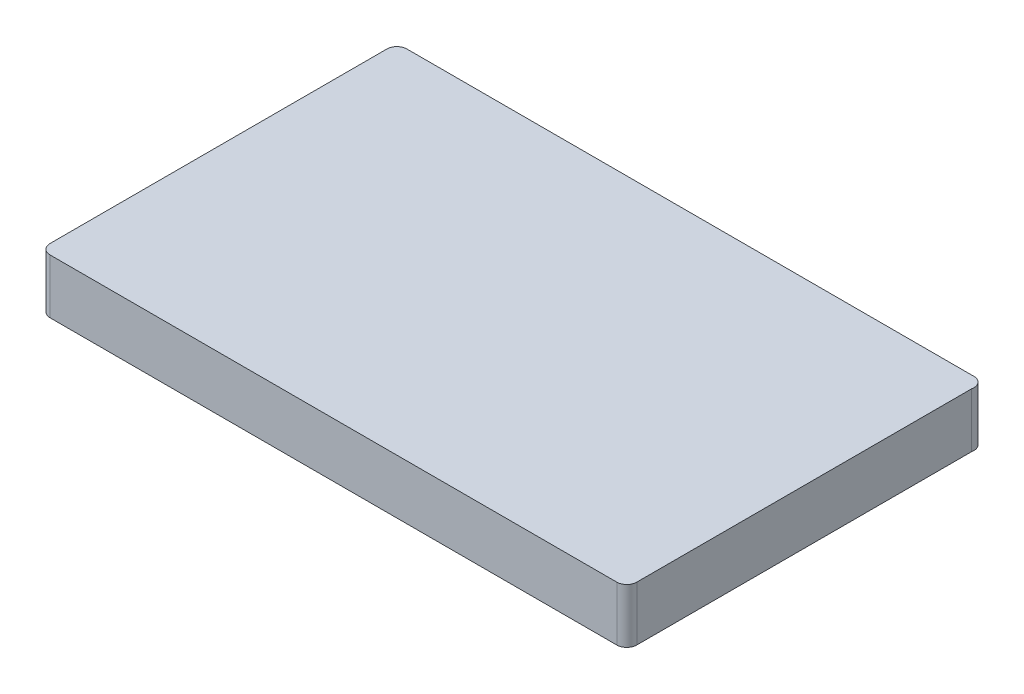
ISO-10303-21;
HEADER;
FILE_DESCRIPTION(('STEP AP214'),'2;1');
FILE_NAME('part.step','',(''),(''),'','','');
FILE_SCHEMA(('AUTOMOTIVE_DESIGN { 1 0 10303 214 1 1 1 1 }'));
ENDSEC;
DATA;
#1=APPLICATION_CONTEXT('core data for automotive mechanical design processes');
#2=APPLICATION_PROTOCOL_DEFINITION('international standard','automotive_design',2000,#1);
#3=PRODUCT_CONTEXT('',#1,'mechanical');
#4=PRODUCT('Part','Part','',(#3));
#5=PRODUCT_RELATED_PRODUCT_CATEGORY('part','',(#4));
#6=PRODUCT_DEFINITION_FORMATION('','',#4);
#7=PRODUCT_DEFINITION_CONTEXT('part definition',#1,'design');
#8=PRODUCT_DEFINITION('design','',#6,#7);
#9=PRODUCT_DEFINITION_SHAPE('','',#8);
#10=(LENGTH_UNIT() NAMED_UNIT(*) SI_UNIT(.MILLI.,.METRE.));
#11=(NAMED_UNIT(*) PLANE_ANGLE_UNIT() SI_UNIT($,.RADIAN.));
#12=(NAMED_UNIT(*) SI_UNIT($,.STERADIAN.) SOLID_ANGLE_UNIT());
#13=UNCERTAINTY_MEASURE_WITH_UNIT(LENGTH_MEASURE(1.E-05),#10,'distance_accuracy_value','');
#14=(GEOMETRIC_REPRESENTATION_CONTEXT(3) GLOBAL_UNCERTAINTY_ASSIGNED_CONTEXT((#13)) GLOBAL_UNIT_ASSIGNED_CONTEXT((#10,
#11,#12)) REPRESENTATION_CONTEXT('',''));
#15=CARTESIAN_POINT('',(0.,0.,0.));
#16=DIRECTION('',(0.,0.,1.));
#17=DIRECTION('',(1.,0.,0.));
#18=AXIS2_PLACEMENT_3D('',#15,#16,#17);
#19=CARTESIAN_POINT('',(-71.,13.65,42.2));
#20=DIRECTION('',(0.,-1.,0.));
#21=DIRECTION('',(0.,0.,-1.));
#22=AXIS2_PLACEMENT_3D('',#19,#20,#21);
#23=CYLINDRICAL_SURFACE('',#22,2.50000000000006);
#24=CARTESIAN_POINT('',(-71.,0.,42.2));
#25=DIRECTION('',(0.,1.,0.));
#26=DIRECTION('',(0.,0.,1.));
#27=AXIS2_PLACEMENT_3D('',#24,#25,#26);
#28=CIRCLE('',#27,2.50000000000006);
#29=CARTESIAN_POINT('',(-73.5000000000001,0.,42.2));
#30=VERTEX_POINT('',#29);
#31=CARTESIAN_POINT('',(-71.,0.,44.7));
#32=VERTEX_POINT('',#31);
#33=EDGE_CURVE('E129',#30,#32,#28,.T.);
#34=ORIENTED_EDGE('',*,*,#33,.T.);
#35=DIRECTION('',(0.,-1.,0.));
#36=VECTOR('',#35,1.);
#37=CARTESIAN_POINT('',(-71.,13.65,44.7));
#38=LINE('',#37,#36);
#39=CARTESIAN_POINT('',(-71.,13.65,44.7));
#40=VERTEX_POINT('',#39);
#41=EDGE_CURVE('E11',#40,#32,#38,.T.);
#42=ORIENTED_EDGE('',*,*,#41,.F.);
#43=CARTESIAN_POINT('',(-71.,13.65,42.2));
#44=DIRECTION('',(0.,1.,0.));
#45=DIRECTION('',(0.,0.,1.));
#46=AXIS2_PLACEMENT_3D('',#43,#44,#45);
#47=CIRCLE('',#46,2.50000000000006);
#48=CARTESIAN_POINT('',(-73.5000000000001,13.65,42.2));
#49=VERTEX_POINT('',#48);
#50=EDGE_CURVE('E143',#49,#40,#47,.T.);
#51=ORIENTED_EDGE('',*,*,#50,.F.);
#52=DIRECTION('',(0.,-1.,0.));
#53=VECTOR('',#52,1.);
#54=CARTESIAN_POINT('',(-73.5000000000001,13.65,42.2));
#55=LINE('',#54,#53);
#56=EDGE_CURVE('E125',#49,#30,#55,.T.);
#57=ORIENTED_EDGE('',*,*,#56,.T.);
#58=EDGE_LOOP('',(#34,#42,#51,#57));
#59=FACE_BOUND('',#58,.T.);
#60=ADVANCED_FACE('F33',(#59),#23,.T.);
#61=CARTESIAN_POINT('',(71.,13.65,44.7));
#62=DIRECTION('',(0.,0.,-1.));
#63=DIRECTION('',(-1.,0.,0.));
#64=AXIS2_PLACEMENT_3D('',#61,#62,#63);
#65=PLANE('',#64);
#66=DIRECTION('',(1.,0.,0.));
#67=VECTOR('',#66,1.);
#68=CARTESIAN_POINT('',(71.,0.,44.7));
#69=LINE('',#68,#67);
#70=CARTESIAN_POINT('',(71.,0.,44.7));
#71=VERTEX_POINT('',#70);
#72=EDGE_CURVE('E132',#32,#71,#69,.T.);
#73=ORIENTED_EDGE('',*,*,#72,.T.);
#74=DIRECTION('',(0.,-1.,0.));
#75=VECTOR('',#74,1.);
#76=CARTESIAN_POINT('',(71.,13.65,44.7));
#77=LINE('',#76,#75);
#78=CARTESIAN_POINT('',(71.,13.65,44.7));
#79=VERTEX_POINT('',#78);
#80=EDGE_CURVE('E41',#79,#71,#77,.T.);
#81=ORIENTED_EDGE('',*,*,#80,.F.);
#82=DIRECTION('',(1.,0.,0.));
#83=VECTOR('',#82,1.);
#84=CARTESIAN_POINT('',(71.,13.65,44.7));
#85=LINE('',#84,#83);
#86=EDGE_CURVE('E92',#40,#79,#85,.T.);
#87=ORIENTED_EDGE('',*,*,#86,.F.);
#88=ORIENTED_EDGE('',*,*,#41,.T.);
#89=EDGE_LOOP('',(#73,#81,#87,#88));
#90=FACE_BOUND('',#89,.T.);
#91=ADVANCED_FACE('F178',(#90),#65,.F.);
#92=CARTESIAN_POINT('',(71.,13.65,42.2));
#93=DIRECTION('',(0.,-1.,0.));
#94=DIRECTION('',(0.,0.,-1.));
#95=AXIS2_PLACEMENT_3D('',#92,#93,#94);
#96=CYLINDRICAL_SURFACE('',#95,2.49999999999996);
#97=CARTESIAN_POINT('',(71.,0.,42.2));
#98=DIRECTION('',(0.,1.,0.));
#99=DIRECTION('',(0.,0.,1.));
#100=AXIS2_PLACEMENT_3D('',#97,#98,#99);
#101=CIRCLE('',#100,2.49999999999996);
#102=CARTESIAN_POINT('',(73.4999999999999,0.,42.2));
#103=VERTEX_POINT('',#102);
#104=EDGE_CURVE('E134',#71,#103,#101,.T.);
#105=ORIENTED_EDGE('',*,*,#104,.T.);
#106=DIRECTION('',(0.,-1.,0.));
#107=VECTOR('',#106,1.);
#108=CARTESIAN_POINT('',(73.4999999999999,13.65,42.2));
#109=LINE('',#108,#107);
#110=CARTESIAN_POINT('',(73.4999999999999,13.65,42.2));
#111=VERTEX_POINT('',#110);
#112=EDGE_CURVE('E150',#111,#103,#109,.T.);
#113=ORIENTED_EDGE('',*,*,#112,.F.);
#114=CARTESIAN_POINT('',(71.,13.65,42.2));
#115=DIRECTION('',(0.,1.,0.));
#116=DIRECTION('',(0.,0.,1.));
#117=AXIS2_PLACEMENT_3D('',#114,#115,#116);
#118=CIRCLE('',#117,2.49999999999996);
#119=EDGE_CURVE('E158',#79,#111,#118,.T.);
#120=ORIENTED_EDGE('',*,*,#119,.F.);
#121=ORIENTED_EDGE('',*,*,#80,.T.);
#122=EDGE_LOOP('',(#105,#113,#120,#121));
#123=FACE_BOUND('',#122,.T.);
#124=ADVANCED_FACE('F156',(#123),#96,.T.);
#125=CARTESIAN_POINT('',(73.4999999999999,13.65,42.2));
#126=DIRECTION('',(-1.,0.,0.));
#127=DIRECTION('',(0.,0.,1.));
#128=AXIS2_PLACEMENT_3D('',#125,#126,#127);
#129=PLANE('',#128);
#130=DIRECTION('',(0.,0.,-1.));
#131=VECTOR('',#130,1.);
#132=CARTESIAN_POINT('',(73.4999999999999,0.,42.2));
#133=LINE('',#132,#131);
#134=CARTESIAN_POINT('',(73.4999999999999,0.,-41.7174376150512));
#135=VERTEX_POINT('',#134);
#136=EDGE_CURVE('E136',#103,#135,#133,.T.);
#137=ORIENTED_EDGE('',*,*,#136,.T.);
#138=DIRECTION('',(0.,-1.,0.));
#139=VECTOR('',#138,1.);
#140=CARTESIAN_POINT('',(73.4999999999999,13.65,-41.7174376150512));
#141=LINE('',#140,#139);
#142=CARTESIAN_POINT('',(73.4999999999999,13.65,-41.7174376150512));
#143=VERTEX_POINT('',#142);
#144=EDGE_CURVE('E147',#143,#135,#141,.T.);
#145=ORIENTED_EDGE('',*,*,#144,.F.);
#146=DIRECTION('',(0.,0.,-1.));
#147=VECTOR('',#146,1.);
#148=CARTESIAN_POINT('',(73.4999999999999,13.65,42.2));
#149=LINE('',#148,#147);
#150=EDGE_CURVE('E170',#111,#143,#149,.T.);
#151=ORIENTED_EDGE('',*,*,#150,.F.);
#152=ORIENTED_EDGE('',*,*,#112,.T.);
#153=EDGE_LOOP('',(#137,#145,#151,#152));
#154=FACE_BOUND('',#153,.T.);
#155=ADVANCED_FACE('F166',(#154),#129,.F.);
#156=CARTESIAN_POINT('',(71.0515540156393,13.65,-42.2225240053535));
#157=DIRECTION('',(0.,-1.,0.));
#158=DIRECTION('',(0.,0.,-1.));
#159=AXIS2_PLACEMENT_3D('',#156,#157,#158);
#160=CYLINDRICAL_SURFACE('',#159,2.5);
#161=CARTESIAN_POINT('',(71.0515540156393,0.,-42.2225240053535));
#162=DIRECTION('',(0.,1.,0.));
#163=DIRECTION('',(0.,0.,1.));
#164=AXIS2_PLACEMENT_3D('',#161,#162,#163);
#165=CIRCLE('',#164,2.5);
#166=CARTESIAN_POINT('',(70.7167216755788,0.,-44.7));
#167=VERTEX_POINT('',#166);
#168=EDGE_CURVE('E138',#135,#167,#165,.T.);
#169=ORIENTED_EDGE('',*,*,#168,.T.);
#170=DIRECTION('',(0.,-1.,0.));
#171=VECTOR('',#170,1.);
#172=CARTESIAN_POINT('',(70.7167216755788,13.65,-44.7));
#173=LINE('',#172,#171);
#174=CARTESIAN_POINT('',(70.7167216755788,13.65,-44.7));
#175=VERTEX_POINT('',#174);
#176=EDGE_CURVE('E120',#175,#167,#173,.T.);
#177=ORIENTED_EDGE('',*,*,#176,.F.);
#178=CARTESIAN_POINT('',(71.0515540156393,13.65,-42.2225240053535));
#179=DIRECTION('',(0.,1.,0.));
#180=DIRECTION('',(0.,0.,1.));
#181=AXIS2_PLACEMENT_3D('',#178,#179,#180);
#182=CIRCLE('',#181,2.5);
#183=EDGE_CURVE('E111',#143,#175,#182,.T.);
#184=ORIENTED_EDGE('',*,*,#183,.F.);
#185=ORIENTED_EDGE('',*,*,#144,.T.);
#186=EDGE_LOOP('',(#169,#177,#184,#185));
#187=FACE_BOUND('',#186,.T.);
#188=ADVANCED_FACE('F169',(#187),#160,.T.);
#189=CARTESIAN_POINT('',(70.7167216755788,13.65,-44.7));
#190=DIRECTION('',(0.,0.,1.));
#191=DIRECTION('',(1.,0.,0.));
#192=AXIS2_PLACEMENT_3D('',#189,#190,#191);
#193=PLANE('',#192);
#194=DIRECTION('',(-1.,0.,0.));
#195=VECTOR('',#194,1.);
#196=CARTESIAN_POINT('',(70.7167216755788,0.,-44.7));
#197=LINE('',#196,#195);
#198=CARTESIAN_POINT('',(-71.,0.,-44.7));
#199=VERTEX_POINT('',#198);
#200=EDGE_CURVE('E119',#167,#199,#197,.T.);
#201=ORIENTED_EDGE('',*,*,#200,.T.);
#202=DIRECTION('',(0.,-1.,0.));
#203=VECTOR('',#202,1.);
#204=CARTESIAN_POINT('',(-71.,13.65,-44.7));
#205=LINE('',#204,#203);
#206=CARTESIAN_POINT('',(-71.,13.65,-44.7));
#207=VERTEX_POINT('',#206);
#208=EDGE_CURVE('E116',#207,#199,#205,.T.);
#209=ORIENTED_EDGE('',*,*,#208,.F.);
#210=DIRECTION('',(-1.,0.,0.));
#211=VECTOR('',#210,1.);
#212=CARTESIAN_POINT('',(70.7167216755788,13.65,-44.7));
#213=LINE('',#212,#211);
#214=EDGE_CURVE('E105',#175,#207,#213,.T.);
#215=ORIENTED_EDGE('',*,*,#214,.F.);
#216=ORIENTED_EDGE('',*,*,#176,.T.);
#217=EDGE_LOOP('',(#201,#209,#215,#216));
#218=FACE_BOUND('',#217,.T.);
#219=ADVANCED_FACE('F117',(#218),#193,.F.);
#220=CARTESIAN_POINT('',(-71.,13.65,-42.2));
#221=DIRECTION('',(0.,-1.,0.));
#222=DIRECTION('',(0.,0.,-1.));
#223=AXIS2_PLACEMENT_3D('',#220,#221,#222);
#224=CYLINDRICAL_SURFACE('',#223,2.50000000000003);
#225=CARTESIAN_POINT('',(-71.,0.,-42.2));
#226=DIRECTION('',(0.,1.,0.));
#227=DIRECTION('',(0.,0.,1.));
#228=AXIS2_PLACEMENT_3D('',#225,#226,#227);
#229=CIRCLE('',#228,2.50000000000003);
#230=CARTESIAN_POINT('',(-73.5000000000001,0.,-42.2));
#231=VERTEX_POINT('',#230);
#232=EDGE_CURVE('E78',#199,#231,#229,.T.);
#233=ORIENTED_EDGE('',*,*,#232,.T.);
#234=DIRECTION('',(0.,-1.,0.));
#235=VECTOR('',#234,1.);
#236=CARTESIAN_POINT('',(-73.5000000000001,13.65,-42.2));
#237=LINE('',#236,#235);
#238=CARTESIAN_POINT('',(-73.5000000000001,13.65,-42.2));
#239=VERTEX_POINT('',#238);
#240=EDGE_CURVE('E121',#239,#231,#237,.T.);
#241=ORIENTED_EDGE('',*,*,#240,.F.);
#242=CARTESIAN_POINT('',(-71.,13.65,-42.2));
#243=DIRECTION('',(0.,1.,0.));
#244=DIRECTION('',(0.,0.,1.));
#245=AXIS2_PLACEMENT_3D('',#242,#243,#244);
#246=CIRCLE('',#245,2.50000000000003);
#247=EDGE_CURVE('E109',#207,#239,#246,.T.);
#248=ORIENTED_EDGE('',*,*,#247,.F.);
#249=ORIENTED_EDGE('',*,*,#208,.T.);
#250=EDGE_LOOP('',(#233,#241,#248,#249));
#251=FACE_BOUND('',#250,.T.);
#252=ADVANCED_FACE('F123',(#251),#224,.T.);
#253=CARTESIAN_POINT('',(-73.5000000000001,13.65,42.2));
#254=DIRECTION('',(1.,0.,0.));
#255=DIRECTION('',(0.,0.,-1.));
#256=AXIS2_PLACEMENT_3D('',#253,#254,#255);
#257=PLANE('',#256);
#258=DIRECTION('',(0.,0.,1.));
#259=VECTOR('',#258,1.);
#260=CARTESIAN_POINT('',(-73.5000000000001,0.,42.2));
#261=LINE('',#260,#259);
#262=EDGE_CURVE('E84',#231,#30,#261,.T.);
#263=ORIENTED_EDGE('',*,*,#262,.T.);
#264=ORIENTED_EDGE('',*,*,#56,.F.);
#265=DIRECTION('',(0.,0.,1.));
#266=VECTOR('',#265,1.);
#267=CARTESIAN_POINT('',(-73.5000000000001,13.65,42.2));
#268=LINE('',#267,#266);
#269=EDGE_CURVE('E49',#239,#49,#268,.T.);
#270=ORIENTED_EDGE('',*,*,#269,.F.);
#271=ORIENTED_EDGE('',*,*,#240,.T.);
#272=EDGE_LOOP('',(#263,#264,#270,#271));
#273=FACE_BOUND('',#272,.T.);
#274=ADVANCED_FACE('F194',(#273),#257,.F.);
#275=CARTESIAN_POINT('',(-71.,13.65,42.2));
#276=DIRECTION('',(0.,1.,0.));
#277=DIRECTION('',(0.,0.,1.));
#278=AXIS2_PLACEMENT_3D('',#275,#276,#277);
#279=PLANE('',#278);
#280=ORIENTED_EDGE('',*,*,#50,.T.);
#281=ORIENTED_EDGE('',*,*,#86,.T.);
#282=ORIENTED_EDGE('',*,*,#119,.T.);
#283=ORIENTED_EDGE('',*,*,#150,.T.);
#284=ORIENTED_EDGE('',*,*,#183,.T.);
#285=ORIENTED_EDGE('',*,*,#214,.T.);
#286=ORIENTED_EDGE('',*,*,#247,.T.);
#287=ORIENTED_EDGE('',*,*,#269,.T.);
#288=EDGE_LOOP('',(#280,#281,#282,#283,#284,#285,#286,#287));
#289=FACE_BOUND('',#288,.T.);
#290=ADVANCED_FACE('F107',(#289),#279,.T.);
#291=CARTESIAN_POINT('',(-71.,0.,42.2));
#292=DIRECTION('',(0.,1.,0.));
#293=DIRECTION('',(0.,0.,1.));
#294=AXIS2_PLACEMENT_3D('',#291,#292,#293);
#295=PLANE('',#294);
#296=ORIENTED_EDGE('',*,*,#33,.F.);
#297=ORIENTED_EDGE('',*,*,#262,.F.);
#298=ORIENTED_EDGE('',*,*,#232,.F.);
#299=ORIENTED_EDGE('',*,*,#200,.F.);
#300=ORIENTED_EDGE('',*,*,#168,.F.);
#301=ORIENTED_EDGE('',*,*,#136,.F.);
#302=ORIENTED_EDGE('',*,*,#104,.F.);
#303=ORIENTED_EDGE('',*,*,#72,.F.);
#304=EDGE_LOOP('',(#296,#297,#298,#299,#300,#301,#302,#303));
#305=FACE_BOUND('',#304,.T.);
#306=ADVANCED_FACE('F162',(#305),#295,.F.);
#307=CLOSED_SHELL('',(#60,#91,#124,#155,#188,#219,#252,#274,#290,#306));
#308=MANIFOLD_SOLID_BREP('B2',#307);
#309=ADVANCED_BREP_SHAPE_REPRESENTATION('',(#18,#308),#14);
#310=SHAPE_DEFINITION_REPRESENTATION(#9,#309);
ENDSEC;
END-ISO-10303-21;
